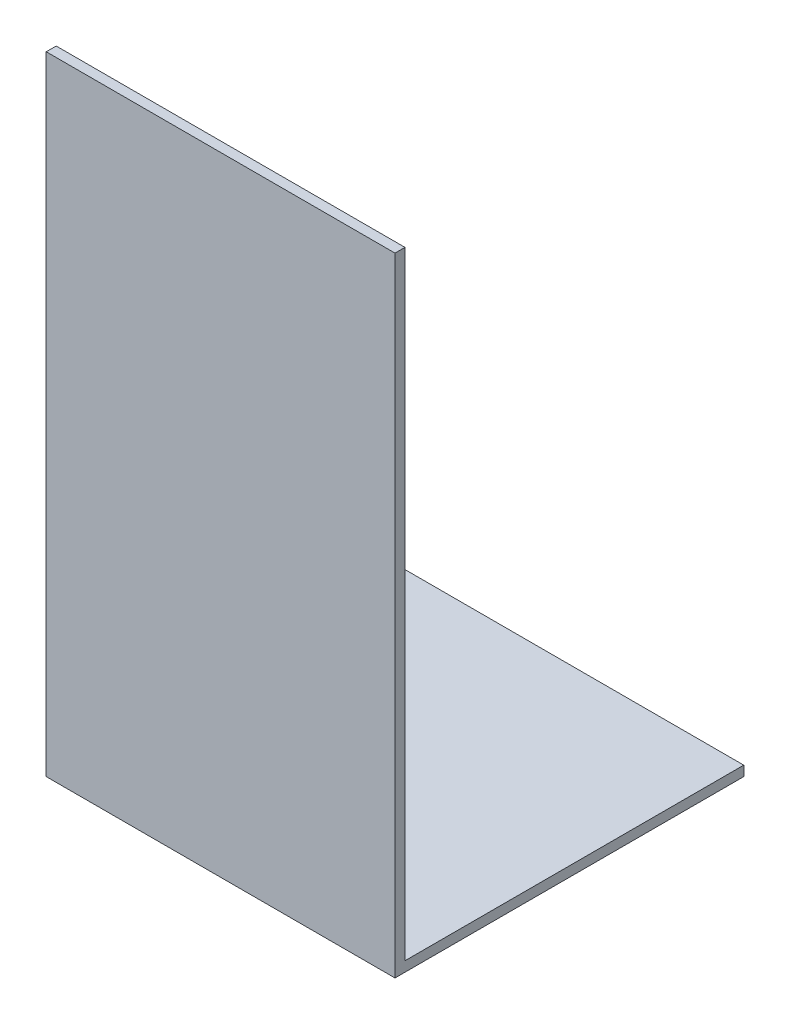
ISO-10303-21;
HEADER;
FILE_DESCRIPTION(('STEP AP214'),'2;1');
FILE_NAME('part.step','',(''),(''),'','','');
FILE_SCHEMA(('AUTOMOTIVE_DESIGN { 1 0 10303 214 1 1 1 1 }'));
ENDSEC;
DATA;
#1=APPLICATION_CONTEXT('core data for automotive mechanical design processes');
#2=APPLICATION_PROTOCOL_DEFINITION('international standard','automotive_design',2000,#1);
#3=PRODUCT_CONTEXT('',#1,'mechanical');
#4=PRODUCT('Part','Part','',(#3));
#5=PRODUCT_RELATED_PRODUCT_CATEGORY('part','',(#4));
#6=PRODUCT_DEFINITION_FORMATION('','',#4);
#7=PRODUCT_DEFINITION_CONTEXT('part definition',#1,'design');
#8=PRODUCT_DEFINITION('design','',#6,#7);
#9=PRODUCT_DEFINITION_SHAPE('','',#8);
#10=(LENGTH_UNIT() NAMED_UNIT(*) SI_UNIT(.MILLI.,.METRE.));
#11=(NAMED_UNIT(*) PLANE_ANGLE_UNIT() SI_UNIT($,.RADIAN.));
#12=(NAMED_UNIT(*) SI_UNIT($,.STERADIAN.) SOLID_ANGLE_UNIT());
#13=UNCERTAINTY_MEASURE_WITH_UNIT(LENGTH_MEASURE(1.E-05),#10,'distance_accuracy_value','');
#14=(GEOMETRIC_REPRESENTATION_CONTEXT(3) GLOBAL_UNCERTAINTY_ASSIGNED_CONTEXT((#13)) GLOBAL_UNIT_ASSIGNED_CONTEXT((#10,
#11,#12)) REPRESENTATION_CONTEXT('',''));
#15=CARTESIAN_POINT('',(0.,0.,0.));
#16=DIRECTION('',(0.,0.,1.));
#17=DIRECTION('',(1.,0.,0.));
#18=AXIS2_PLACEMENT_3D('',#15,#16,#17);
#19=CARTESIAN_POINT('',(0.,1.,0.));
#20=DIRECTION('',(1.,0.,0.));
#21=DIRECTION('',(0.,0.,-1.));
#22=AXIS2_PLACEMENT_3D('',#19,#20,#21);
#23=PLANE('',#22);
#24=DIRECTION('',(0.,0.,1.));
#25=VECTOR('',#24,1.);
#26=CARTESIAN_POINT('',(0.,0.,0.));
#27=LINE('',#26,#25);
#28=CARTESIAN_POINT('',(0.,0.,-35.));
#29=VERTEX_POINT('',#28);
#30=CARTESIAN_POINT('',(0.,0.,0.));
#31=VERTEX_POINT('',#30);
#32=EDGE_CURVE('E91',#29,#31,#27,.T.);
#33=ORIENTED_EDGE('',*,*,#32,.T.);
#34=DIRECTION('',(0.,-1.,0.));
#35=VECTOR('',#34,1.);
#36=CARTESIAN_POINT('',(0.,1.,0.));
#37=LINE('',#36,#35);
#38=CARTESIAN_POINT('',(0.,63.,0.));
#39=VERTEX_POINT('',#38);
#40=EDGE_CURVE('E11',#39,#31,#37,.T.);
#41=ORIENTED_EDGE('',*,*,#40,.F.);
#42=DIRECTION('',(0.,0.,1.));
#43=VECTOR('',#42,1.);
#44=CARTESIAN_POINT('',(0.,63.,0.));
#45=LINE('',#44,#43);
#46=CARTESIAN_POINT('',(0.,63.,-1.));
#47=VERTEX_POINT('',#46);
#48=EDGE_CURVE('E124',#47,#39,#45,.T.);
#49=ORIENTED_EDGE('',*,*,#48,.F.);
#50=DIRECTION('',(0.,-1.,0.));
#51=VECTOR('',#50,1.);
#52=CARTESIAN_POINT('',(0.,63.,-1.));
#53=LINE('',#52,#51);
#54=CARTESIAN_POINT('',(0.,1.,-1.));
#55=VERTEX_POINT('',#54);
#56=EDGE_CURVE('E96',#47,#55,#53,.T.);
#57=ORIENTED_EDGE('',*,*,#56,.T.);
#58=DIRECTION('',(0.,0.,1.));
#59=VECTOR('',#58,1.);
#60=CARTESIAN_POINT('',(0.,1.,0.));
#61=LINE('',#60,#59);
#62=CARTESIAN_POINT('',(0.,1.,-35.));
#63=VERTEX_POINT('',#62);
#64=EDGE_CURVE('E85',#63,#55,#61,.T.);
#65=ORIENTED_EDGE('',*,*,#64,.F.);
#66=DIRECTION('',(0.,-1.,0.));
#67=VECTOR('',#66,1.);
#68=CARTESIAN_POINT('',(0.,1.,-35.));
#69=LINE('',#68,#67);
#70=EDGE_CURVE('E78',#63,#29,#69,.T.);
#71=ORIENTED_EDGE('',*,*,#70,.T.);
#72=EDGE_LOOP('',(#33,#41,#49,#57,#65,#71));
#73=FACE_BOUND('',#72,.T.);
#74=ADVANCED_FACE('F33',(#73),#23,.F.);
#75=CARTESIAN_POINT('',(0.,1.,0.));
#76=DIRECTION('',(0.,0.,-1.));
#77=DIRECTION('',(-1.,0.,0.));
#78=AXIS2_PLACEMENT_3D('',#75,#76,#77);
#79=PLANE('',#78);
#80=DIRECTION('',(1.,0.,0.));
#81=VECTOR('',#80,1.);
#82=CARTESIAN_POINT('',(0.,0.,0.));
#83=LINE('',#82,#81);
#84=CARTESIAN_POINT('',(35.,0.,0.));
#85=VERTEX_POINT('',#84);
#86=EDGE_CURVE('E95',#31,#85,#83,.T.);
#87=ORIENTED_EDGE('',*,*,#86,.T.);
#88=DIRECTION('',(0.,-1.,0.));
#89=VECTOR('',#88,1.);
#90=CARTESIAN_POINT('',(35.,1.,0.));
#91=LINE('',#90,#89);
#92=CARTESIAN_POINT('',(35.,63.,0.));
#93=VERTEX_POINT('',#92);
#94=EDGE_CURVE('E40',#93,#85,#91,.T.);
#95=ORIENTED_EDGE('',*,*,#94,.F.);
#96=DIRECTION('',(1.,0.,0.));
#97=VECTOR('',#96,1.);
#98=CARTESIAN_POINT('',(0.,63.,0.));
#99=LINE('',#98,#97);
#100=EDGE_CURVE('E117',#39,#93,#99,.T.);
#101=ORIENTED_EDGE('',*,*,#100,.F.);
#102=ORIENTED_EDGE('',*,*,#40,.T.);
#103=EDGE_LOOP('',(#87,#95,#101,#102));
#104=FACE_BOUND('',#103,.T.);
#105=ADVANCED_FACE('F115',(#104),#79,.F.);
#106=CARTESIAN_POINT('',(35.,1.,0.));
#107=DIRECTION('',(-1.,0.,0.));
#108=DIRECTION('',(0.,0.,1.));
#109=AXIS2_PLACEMENT_3D('',#106,#107,#108);
#110=PLANE('',#109);
#111=DIRECTION('',(0.,0.,-1.));
#112=VECTOR('',#111,1.);
#113=CARTESIAN_POINT('',(35.,0.,0.));
#114=LINE('',#113,#112);
#115=CARTESIAN_POINT('',(35.,0.,-35.));
#116=VERTEX_POINT('',#115);
#117=EDGE_CURVE('E86',#85,#116,#114,.T.);
#118=ORIENTED_EDGE('',*,*,#117,.T.);
#119=DIRECTION('',(0.,-1.,0.));
#120=VECTOR('',#119,1.);
#121=CARTESIAN_POINT('',(35.,1.,-35.));
#122=LINE('',#121,#120);
#123=CARTESIAN_POINT('',(35.,1.,-35.));
#124=VERTEX_POINT('',#123);
#125=EDGE_CURVE('E81',#124,#116,#122,.T.);
#126=ORIENTED_EDGE('',*,*,#125,.F.);
#127=DIRECTION('',(0.,0.,-1.));
#128=VECTOR('',#127,1.);
#129=CARTESIAN_POINT('',(35.,1.,0.));
#130=LINE('',#129,#128);
#131=CARTESIAN_POINT('',(35.,1.,-1.));
#132=VERTEX_POINT('',#131);
#133=EDGE_CURVE('E134',#132,#124,#130,.T.);
#134=ORIENTED_EDGE('',*,*,#133,.F.);
#135=DIRECTION('',(0.,-1.,0.));
#136=VECTOR('',#135,1.);
#137=CARTESIAN_POINT('',(35.,63.,-1.));
#138=LINE('',#137,#136);
#139=CARTESIAN_POINT('',(35.,63.,-1.));
#140=VERTEX_POINT('',#139);
#141=EDGE_CURVE('E47',#140,#132,#138,.T.);
#142=ORIENTED_EDGE('',*,*,#141,.F.);
#143=DIRECTION('',(0.,0.,-1.));
#144=VECTOR('',#143,1.);
#145=CARTESIAN_POINT('',(35.,63.,0.));
#146=LINE('',#145,#144);
#147=EDGE_CURVE('E111',#93,#140,#146,.T.);
#148=ORIENTED_EDGE('',*,*,#147,.F.);
#149=ORIENTED_EDGE('',*,*,#94,.T.);
#150=EDGE_LOOP('',(#118,#126,#134,#142,#148,#149));
#151=FACE_BOUND('',#150,.T.);
#152=ADVANCED_FACE('F108',(#151),#110,.F.);
#153=CARTESIAN_POINT('',(0.,1.,-35.));
#154=DIRECTION('',(0.,0.,1.));
#155=DIRECTION('',(1.,0.,0.));
#156=AXIS2_PLACEMENT_3D('',#153,#154,#155);
#157=PLANE('',#156);
#158=DIRECTION('',(-1.,0.,0.));
#159=VECTOR('',#158,1.);
#160=CARTESIAN_POINT('',(0.,0.,-35.));
#161=LINE('',#160,#159);
#162=EDGE_CURVE('E75',#116,#29,#161,.T.);
#163=ORIENTED_EDGE('',*,*,#162,.T.);
#164=ORIENTED_EDGE('',*,*,#70,.F.);
#165=DIRECTION('',(-1.,0.,0.));
#166=VECTOR('',#165,1.);
#167=CARTESIAN_POINT('',(0.,1.,-35.));
#168=LINE('',#167,#166);
#169=EDGE_CURVE('E56',#124,#63,#168,.T.);
#170=ORIENTED_EDGE('',*,*,#169,.F.);
#171=ORIENTED_EDGE('',*,*,#125,.T.);
#172=EDGE_LOOP('',(#163,#164,#170,#171));
#173=FACE_BOUND('',#172,.T.);
#174=ADVANCED_FACE('F77',(#173),#157,.F.);
#175=CARTESIAN_POINT('',(0.,1.,0.));
#176=DIRECTION('',(0.,-1.,0.));
#177=DIRECTION('',(0.,0.,-1.));
#178=AXIS2_PLACEMENT_3D('',#175,#176,#177);
#179=PLANE('',#178);
#180=ORIENTED_EDGE('',*,*,#64,.T.);
#181=DIRECTION('',(1.,0.,0.));
#182=VECTOR('',#181,1.);
#183=CARTESIAN_POINT('',(0.,1.,-1.));
#184=LINE('',#183,#182);
#185=EDGE_CURVE('E131',#55,#132,#184,.T.);
#186=ORIENTED_EDGE('',*,*,#185,.T.);
#187=ORIENTED_EDGE('',*,*,#133,.T.);
#188=ORIENTED_EDGE('',*,*,#169,.T.);
#189=EDGE_LOOP('',(#180,#186,#187,#188));
#190=FACE_BOUND('',#189,.T.);
#191=ADVANCED_FACE('F136',(#190),#179,.F.);
#192=CARTESIAN_POINT('',(0.,0.,0.));
#193=DIRECTION('',(0.,-1.,0.));
#194=DIRECTION('',(0.,0.,-1.));
#195=AXIS2_PLACEMENT_3D('',#192,#193,#194);
#196=PLANE('',#195);
#197=ORIENTED_EDGE('',*,*,#32,.F.);
#198=ORIENTED_EDGE('',*,*,#162,.F.);
#199=ORIENTED_EDGE('',*,*,#117,.F.);
#200=ORIENTED_EDGE('',*,*,#86,.F.);
#201=EDGE_LOOP('',(#197,#198,#199,#200));
#202=FACE_BOUND('',#201,.T.);
#203=ADVANCED_FACE('F94',(#202),#196,.T.);
#204=CARTESIAN_POINT('',(0.,63.,-1.));
#205=DIRECTION('',(0.,0.,-1.));
#206=DIRECTION('',(-1.,0.,0.));
#207=AXIS2_PLACEMENT_3D('',#204,#205,#206);
#208=PLANE('',#207);
#209=ORIENTED_EDGE('',*,*,#185,.F.);
#210=ORIENTED_EDGE('',*,*,#56,.F.);
#211=DIRECTION('',(1.,0.,0.));
#212=VECTOR('',#211,1.);
#213=CARTESIAN_POINT('',(0.,63.,-1.));
#214=LINE('',#213,#212);
#215=EDGE_CURVE('E127',#47,#140,#214,.T.);
#216=ORIENTED_EDGE('',*,*,#215,.T.);
#217=ORIENTED_EDGE('',*,*,#141,.T.);
#218=EDGE_LOOP('',(#209,#210,#216,#217));
#219=FACE_BOUND('',#218,.T.);
#220=ADVANCED_FACE('F139',(#219),#208,.T.);
#221=CARTESIAN_POINT('',(0.,63.,0.));
#222=DIRECTION('',(0.,1.,0.));
#223=DIRECTION('',(0.,0.,1.));
#224=AXIS2_PLACEMENT_3D('',#221,#222,#223);
#225=PLANE('',#224);
#226=ORIENTED_EDGE('',*,*,#215,.F.);
#227=ORIENTED_EDGE('',*,*,#48,.T.);
#228=ORIENTED_EDGE('',*,*,#100,.T.);
#229=ORIENTED_EDGE('',*,*,#147,.T.);
#230=EDGE_LOOP('',(#226,#227,#228,#229));
#231=FACE_BOUND('',#230,.T.);
#232=ADVANCED_FACE('F122',(#231),#225,.T.);
#233=CLOSED_SHELL('',(#74,#105,#152,#174,#191,#203,#220,#232));
#234=MANIFOLD_SOLID_BREP('B2',#233);
#235=ADVANCED_BREP_SHAPE_REPRESENTATION('',(#18,#234),#14);
#236=SHAPE_DEFINITION_REPRESENTATION(#9,#235);
ENDSEC;
END-ISO-10303-21;
